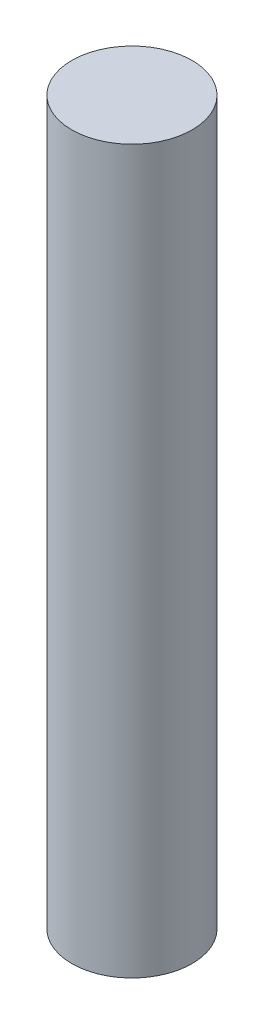
ISO-10303-21;
HEADER;
FILE_DESCRIPTION(('STEP AP214'),'2;1');
FILE_NAME('part.step','',(''),(''),'','','');
FILE_SCHEMA(('AUTOMOTIVE_DESIGN { 1 0 10303 214 1 1 1 1 }'));
ENDSEC;
DATA;
#1=APPLICATION_CONTEXT('core data for automotive mechanical design processes');
#2=APPLICATION_PROTOCOL_DEFINITION('international standard','automotive_design',2000,#1);
#3=PRODUCT_CONTEXT('',#1,'mechanical');
#4=PRODUCT('Part','Part','',(#3));
#5=PRODUCT_RELATED_PRODUCT_CATEGORY('part','',(#4));
#6=PRODUCT_DEFINITION_FORMATION('','',#4);
#7=PRODUCT_DEFINITION_CONTEXT('part definition',#1,'design');
#8=PRODUCT_DEFINITION('design','',#6,#7);
#9=PRODUCT_DEFINITION_SHAPE('','',#8);
#10=(LENGTH_UNIT() NAMED_UNIT(*) SI_UNIT(.MILLI.,.METRE.));
#11=(NAMED_UNIT(*) PLANE_ANGLE_UNIT() SI_UNIT($,.RADIAN.));
#12=(NAMED_UNIT(*) SI_UNIT($,.STERADIAN.) SOLID_ANGLE_UNIT());
#13=UNCERTAINTY_MEASURE_WITH_UNIT(LENGTH_MEASURE(1.E-05),#10,'distance_accuracy_value','');
#14=(GEOMETRIC_REPRESENTATION_CONTEXT(3) GLOBAL_UNCERTAINTY_ASSIGNED_CONTEXT((#13)) GLOBAL_UNIT_ASSIGNED_CONTEXT((#10,
#11,#12)) REPRESENTATION_CONTEXT('',''));
#15=CARTESIAN_POINT('',(0.,0.,0.));
#16=DIRECTION('',(0.,0.,1.));
#17=DIRECTION('',(1.,0.,0.));
#18=AXIS2_PLACEMENT_3D('',#15,#16,#17);
#19=CARTESIAN_POINT('',(0.,30.,0.));
#20=DIRECTION('',(0.,-1.,0.));
#21=DIRECTION('',(0.,0.,-1.));
#22=AXIS2_PLACEMENT_3D('',#19,#20,#21);
#23=CYLINDRICAL_SURFACE('',#22,2.5);
#24=CARTESIAN_POINT('',(0.,30.,0.));
#25=DIRECTION('',(0.,1.,0.));
#26=DIRECTION('',(0.,0.,1.));
#27=AXIS2_PLACEMENT_3D('',#24,#25,#26);
#28=CIRCLE('',#27,2.5);
#29=CARTESIAN_POINT('',(0.,30.,2.5));
#30=VERTEX_POINT('',#29);
#31=EDGE_CURVE('E10',#30,#30,#28,.T.);
#32=ORIENTED_EDGE('',*,*,#31,.F.);
#33=EDGE_LOOP('',(#32));
#34=FACE_BOUND('',#33,.T.);
#35=CARTESIAN_POINT('',(0.,0.,0.));
#36=DIRECTION('',(0.,1.,0.));
#37=DIRECTION('',(0.,0.,1.));
#38=AXIS2_PLACEMENT_3D('',#35,#36,#37);
#39=CIRCLE('',#38,2.5);
#40=CARTESIAN_POINT('',(0.,0.,2.5));
#41=VERTEX_POINT('',#40);
#42=EDGE_CURVE('E35',#41,#41,#39,.T.);
#43=ORIENTED_EDGE('',*,*,#42,.T.);
#44=EDGE_LOOP('',(#43));
#45=FACE_BOUND('',#44,.T.);
#46=ADVANCED_FACE('F32',(#34,#45),#23,.T.);
#47=CARTESIAN_POINT('',(0.,30.,0.));
#48=DIRECTION('',(0.,1.,0.));
#49=DIRECTION('',(0.,0.,1.));
#50=AXIS2_PLACEMENT_3D('',#47,#48,#49);
#51=PLANE('',#50);
#52=ORIENTED_EDGE('',*,*,#31,.T.);
#53=EDGE_LOOP('',(#52));
#54=FACE_BOUND('',#53,.T.);
#55=ADVANCED_FACE('F47',(#54),#51,.T.);
#56=CARTESIAN_POINT('',(0.,0.,0.));
#57=DIRECTION('',(0.,1.,0.));
#58=DIRECTION('',(0.,0.,1.));
#59=AXIS2_PLACEMENT_3D('',#56,#57,#58);
#60=PLANE('',#59);
#61=ORIENTED_EDGE('',*,*,#42,.F.);
#62=EDGE_LOOP('',(#61));
#63=FACE_BOUND('',#62,.T.);
#64=ADVANCED_FACE('F45',(#63),#60,.F.);
#65=CLOSED_SHELL('',(#46,#55,#64));
#66=MANIFOLD_SOLID_BREP('B2',#65);
#67=ADVANCED_BREP_SHAPE_REPRESENTATION('',(#18,#66),#14);
#68=SHAPE_DEFINITION_REPRESENTATION(#9,#67);
ENDSEC;
END-ISO-10303-21;
